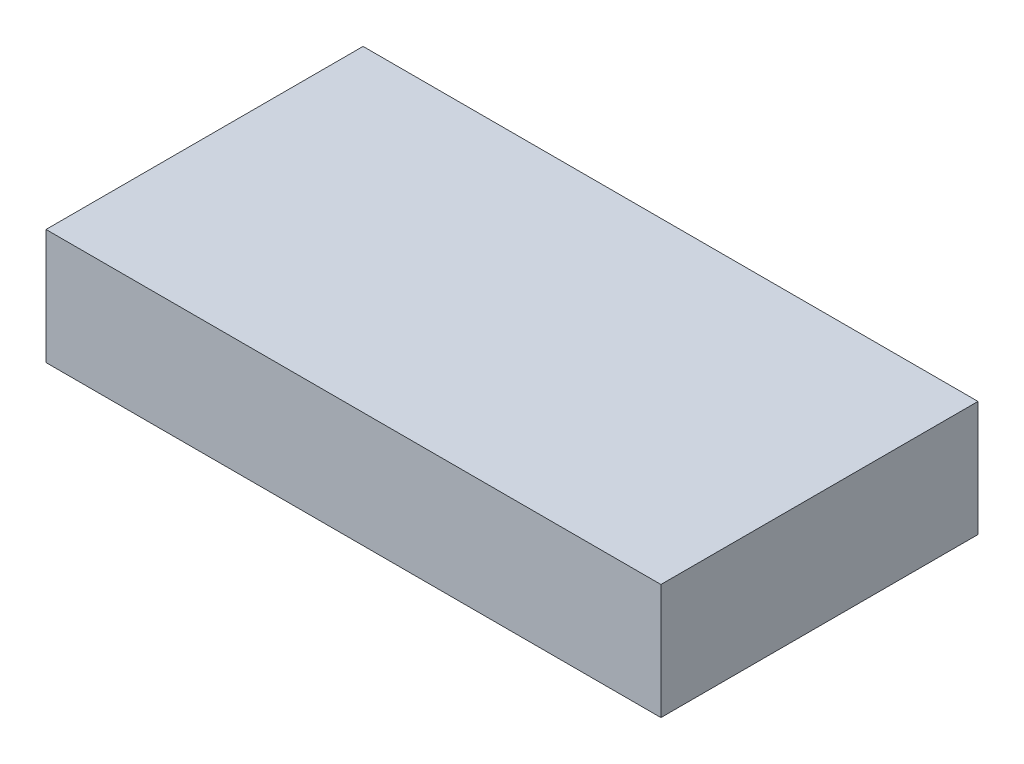
ISO-10303-21;
HEADER;
FILE_DESCRIPTION(('STEP AP214'),'2;1');
FILE_NAME('part.step','',(''),(''),'','','');
FILE_SCHEMA(('AUTOMOTIVE_DESIGN { 1 0 10303 214 1 1 1 1 }'));
ENDSEC;
DATA;
#1=APPLICATION_CONTEXT('core data for automotive mechanical design processes');
#2=APPLICATION_PROTOCOL_DEFINITION('international standard','automotive_design',2000,#1);
#3=PRODUCT_CONTEXT('',#1,'mechanical');
#4=PRODUCT('Part','Part','',(#3));
#5=PRODUCT_RELATED_PRODUCT_CATEGORY('part','',(#4));
#6=PRODUCT_DEFINITION_FORMATION('','',#4);
#7=PRODUCT_DEFINITION_CONTEXT('part definition',#1,'design');
#8=PRODUCT_DEFINITION('design','',#6,#7);
#9=PRODUCT_DEFINITION_SHAPE('','',#8);
#10=(LENGTH_UNIT() NAMED_UNIT(*) SI_UNIT(.MILLI.,.METRE.));
#11=(NAMED_UNIT(*) PLANE_ANGLE_UNIT() SI_UNIT($,.RADIAN.));
#12=(NAMED_UNIT(*) SI_UNIT($,.STERADIAN.) SOLID_ANGLE_UNIT());
#13=UNCERTAINTY_MEASURE_WITH_UNIT(LENGTH_MEASURE(1.E-05),#10,'distance_accuracy_value','');
#14=(GEOMETRIC_REPRESENTATION_CONTEXT(3) GLOBAL_UNCERTAINTY_ASSIGNED_CONTEXT((#13)) GLOBAL_UNIT_ASSIGNED_CONTEXT((#10,
#11,#12)) REPRESENTATION_CONTEXT('',''));
#15=CARTESIAN_POINT('',(0.,0.,0.));
#16=DIRECTION('',(0.,0.,1.));
#17=DIRECTION('',(1.,0.,0.));
#18=AXIS2_PLACEMENT_3D('',#15,#16,#17);
#19=CARTESIAN_POINT('',(-24.0941176470588,12.,3.13725490196078));
#20=DIRECTION('',(1.,0.,0.));
#21=DIRECTION('',(0.,0.,-1.));
#22=AXIS2_PLACEMENT_3D('',#19,#20,#21);
#23=PLANE('',#22);
#24=DIRECTION('',(0.,0.,1.));
#25=VECTOR('',#24,1.);
#26=CARTESIAN_POINT('',(-24.0941176470588,0.,3.13725490196078));
#27=LINE('',#26,#25);
#28=CARTESIAN_POINT('',(-24.0941176470588,0.,3.13725490196078));
#29=VERTEX_POINT('',#28);
#30=CARTESIAN_POINT('',(-24.0941176470588,0.,36.1372549019608));
#31=VERTEX_POINT('',#30);
#32=EDGE_CURVE('E96',#29,#31,#27,.T.);
#33=ORIENTED_EDGE('',*,*,#32,.T.);
#34=DIRECTION('',(0.,-1.,0.));
#35=VECTOR('',#34,1.);
#36=CARTESIAN_POINT('',(-24.0941176470588,12.,36.1372549019608));
#37=LINE('',#36,#35);
#38=CARTESIAN_POINT('',(-24.0941176470588,12.,36.1372549019608));
#39=VERTEX_POINT('',#38);
#40=EDGE_CURVE('E11',#39,#31,#37,.T.);
#41=ORIENTED_EDGE('',*,*,#40,.F.);
#42=DIRECTION('',(0.,0.,1.));
#43=VECTOR('',#42,1.);
#44=CARTESIAN_POINT('',(-24.0941176470588,12.,3.13725490196078));
#45=LINE('',#44,#43);
#46=CARTESIAN_POINT('',(-24.0941176470588,12.,3.13725490196078));
#47=VERTEX_POINT('',#46);
#48=EDGE_CURVE('E84',#47,#39,#45,.T.);
#49=ORIENTED_EDGE('',*,*,#48,.F.);
#50=DIRECTION('',(0.,-1.,0.));
#51=VECTOR('',#50,1.);
#52=CARTESIAN_POINT('',(-24.0941176470588,12.,3.13725490196078));
#53=LINE('',#52,#51);
#54=EDGE_CURVE('E92',#47,#29,#53,.T.);
#55=ORIENTED_EDGE('',*,*,#54,.T.);
#56=EDGE_LOOP('',(#33,#41,#49,#55));
#57=FACE_BOUND('',#56,.T.);
#58=ADVANCED_FACE('F33',(#57),#23,.F.);
#59=CARTESIAN_POINT('',(-24.0941176470588,12.,36.1372549019608));
#60=DIRECTION('',(0.,0.,-1.));
#61=DIRECTION('',(-1.,0.,0.));
#62=AXIS2_PLACEMENT_3D('',#59,#60,#61);
#63=PLANE('',#62);
#64=DIRECTION('',(1.,0.,0.));
#65=VECTOR('',#64,1.);
#66=CARTESIAN_POINT('',(-24.0941176470588,0.,36.1372549019608));
#67=LINE('',#66,#65);
#68=CARTESIAN_POINT('',(39.9058823529412,0.,36.1372549019608));
#69=VERTEX_POINT('',#68);
#70=EDGE_CURVE('E88',#31,#69,#67,.T.);
#71=ORIENTED_EDGE('',*,*,#70,.T.);
#72=DIRECTION('',(0.,-1.,0.));
#73=VECTOR('',#72,1.);
#74=CARTESIAN_POINT('',(39.9058823529412,12.,36.1372549019608));
#75=LINE('',#74,#73);
#76=CARTESIAN_POINT('',(39.9058823529412,12.,36.1372549019608));
#77=VERTEX_POINT('',#76);
#78=EDGE_CURVE('E41',#77,#69,#75,.T.);
#79=ORIENTED_EDGE('',*,*,#78,.F.);
#80=DIRECTION('',(1.,0.,0.));
#81=VECTOR('',#80,1.);
#82=CARTESIAN_POINT('',(-24.0941176470588,12.,36.1372549019608));
#83=LINE('',#82,#81);
#84=EDGE_CURVE('E79',#39,#77,#83,.T.);
#85=ORIENTED_EDGE('',*,*,#84,.F.);
#86=ORIENTED_EDGE('',*,*,#40,.T.);
#87=EDGE_LOOP('',(#71,#79,#85,#86));
#88=FACE_BOUND('',#87,.T.);
#89=ADVANCED_FACE('F87',(#88),#63,.F.);
#90=CARTESIAN_POINT('',(39.9058823529412,12.,3.13725490196078));
#91=DIRECTION('',(-1.,0.,0.));
#92=DIRECTION('',(0.,0.,1.));
#93=AXIS2_PLACEMENT_3D('',#90,#91,#92);
#94=PLANE('',#93);
#95=DIRECTION('',(0.,0.,-1.));
#96=VECTOR('',#95,1.);
#97=CARTESIAN_POINT('',(39.9058823529412,0.,3.13725490196078));
#98=LINE('',#97,#96);
#99=CARTESIAN_POINT('',(39.9058823529412,0.,3.13725490196078));
#100=VERTEX_POINT('',#99);
#101=EDGE_CURVE('E66',#69,#100,#98,.T.);
#102=ORIENTED_EDGE('',*,*,#101,.T.);
#103=DIRECTION('',(0.,-1.,0.));
#104=VECTOR('',#103,1.);
#105=CARTESIAN_POINT('',(39.9058823529412,12.,3.13725490196078));
#106=LINE('',#105,#104);
#107=CARTESIAN_POINT('',(39.9058823529412,12.,3.13725490196078));
#108=VERTEX_POINT('',#107);
#109=EDGE_CURVE('E89',#108,#100,#106,.T.);
#110=ORIENTED_EDGE('',*,*,#109,.F.);
#111=DIRECTION('',(0.,0.,-1.));
#112=VECTOR('',#111,1.);
#113=CARTESIAN_POINT('',(39.9058823529412,12.,3.13725490196078));
#114=LINE('',#113,#112);
#115=EDGE_CURVE('E82',#77,#108,#114,.T.);
#116=ORIENTED_EDGE('',*,*,#115,.F.);
#117=ORIENTED_EDGE('',*,*,#78,.T.);
#118=EDGE_LOOP('',(#102,#110,#116,#117));
#119=FACE_BOUND('',#118,.T.);
#120=ADVANCED_FACE('F90',(#119),#94,.F.);
#121=CARTESIAN_POINT('',(-24.0941176470588,12.,3.13725490196078));
#122=DIRECTION('',(0.,0.,1.));
#123=DIRECTION('',(1.,0.,0.));
#124=AXIS2_PLACEMENT_3D('',#121,#122,#123);
#125=PLANE('',#124);
#126=DIRECTION('',(-1.,0.,0.));
#127=VECTOR('',#126,1.);
#128=CARTESIAN_POINT('',(-24.0941176470588,0.,3.13725490196078));
#129=LINE('',#128,#127);
#130=EDGE_CURVE('E72',#100,#29,#129,.T.);
#131=ORIENTED_EDGE('',*,*,#130,.T.);
#132=ORIENTED_EDGE('',*,*,#54,.F.);
#133=DIRECTION('',(-1.,0.,0.));
#134=VECTOR('',#133,1.);
#135=CARTESIAN_POINT('',(-24.0941176470588,12.,3.13725490196078));
#136=LINE('',#135,#134);
#137=EDGE_CURVE('E49',#108,#47,#136,.T.);
#138=ORIENTED_EDGE('',*,*,#137,.F.);
#139=ORIENTED_EDGE('',*,*,#109,.T.);
#140=EDGE_LOOP('',(#131,#132,#138,#139));
#141=FACE_BOUND('',#140,.T.);
#142=ADVANCED_FACE('F103',(#141),#125,.F.);
#143=CARTESIAN_POINT('',(0.,12.,0.));
#144=DIRECTION('',(0.,1.,0.));
#145=DIRECTION('',(0.,0.,1.));
#146=AXIS2_PLACEMENT_3D('',#143,#144,#145);
#147=PLANE('',#146);
#148=ORIENTED_EDGE('',*,*,#48,.T.);
#149=ORIENTED_EDGE('',*,*,#84,.T.);
#150=ORIENTED_EDGE('',*,*,#115,.T.);
#151=ORIENTED_EDGE('',*,*,#137,.T.);
#152=EDGE_LOOP('',(#148,#149,#150,#151));
#153=FACE_BOUND('',#152,.T.);
#154=ADVANCED_FACE('F80',(#153),#147,.T.);
#155=CARTESIAN_POINT('',(0.,0.,0.));
#156=DIRECTION('',(0.,1.,0.));
#157=DIRECTION('',(0.,0.,1.));
#158=AXIS2_PLACEMENT_3D('',#155,#156,#157);
#159=PLANE('',#158);
#160=ORIENTED_EDGE('',*,*,#32,.F.);
#161=ORIENTED_EDGE('',*,*,#130,.F.);
#162=ORIENTED_EDGE('',*,*,#101,.F.);
#163=ORIENTED_EDGE('',*,*,#70,.F.);
#164=EDGE_LOOP('',(#160,#161,#162,#163));
#165=FACE_BOUND('',#164,.T.);
#166=ADVANCED_FACE('F106',(#165),#159,.F.);
#167=CLOSED_SHELL('',(#58,#89,#120,#142,#154,#166));
#168=MANIFOLD_SOLID_BREP('B2',#167);
#169=ADVANCED_BREP_SHAPE_REPRESENTATION('',(#18,#168),#14);
#170=SHAPE_DEFINITION_REPRESENTATION(#9,#169);
ENDSEC;
END-ISO-10303-21;
